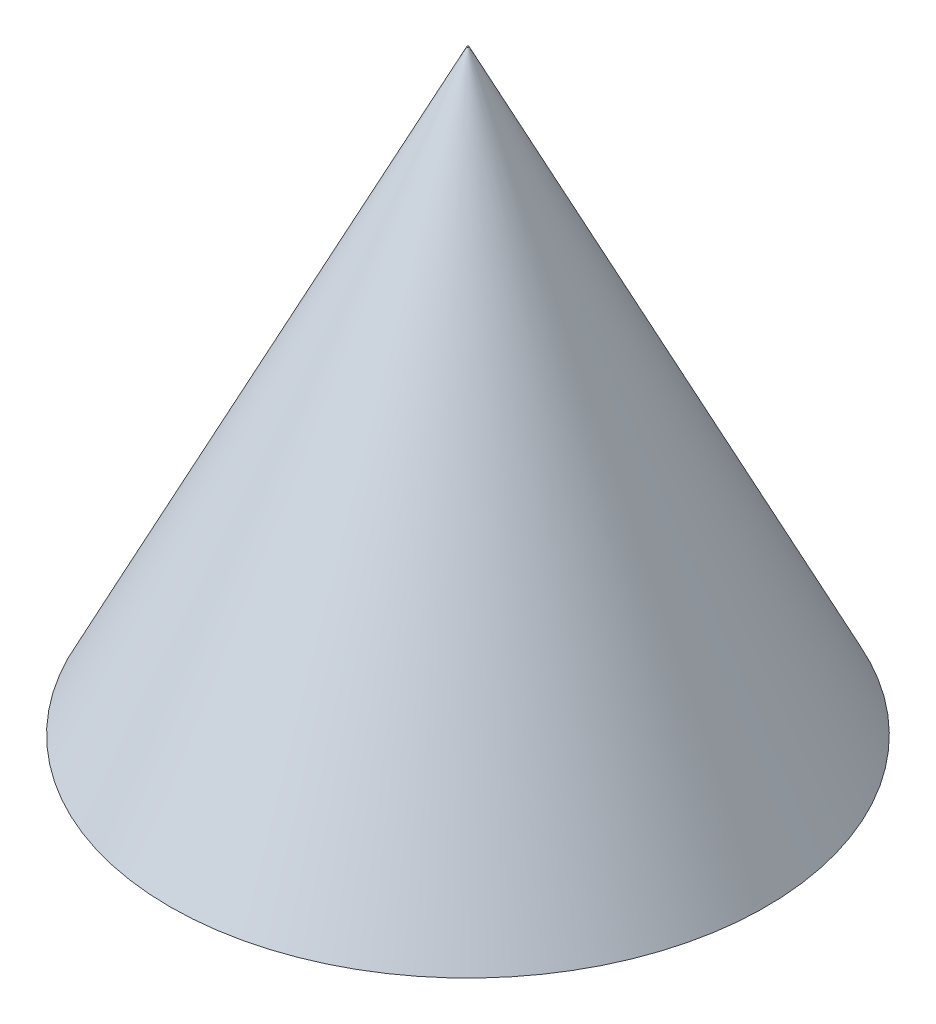
ISO-10303-21;
HEADER;
FILE_DESCRIPTION(('STEP AP214'),'2;1');
FILE_NAME('part.step','',(''),(''),'','','');
FILE_SCHEMA(('AUTOMOTIVE_DESIGN { 1 0 10303 214 1 1 1 1 }'));
ENDSEC;
DATA;
#1=APPLICATION_CONTEXT('core data for automotive mechanical design processes');
#2=APPLICATION_PROTOCOL_DEFINITION('international standard','automotive_design',2000,#1);
#3=PRODUCT_CONTEXT('',#1,'mechanical');
#4=PRODUCT('Part','Part','',(#3));
#5=PRODUCT_RELATED_PRODUCT_CATEGORY('part','',(#4));
#6=PRODUCT_DEFINITION_FORMATION('','',#4);
#7=PRODUCT_DEFINITION_CONTEXT('part definition',#1,'design');
#8=PRODUCT_DEFINITION('design','',#6,#7);
#9=PRODUCT_DEFINITION_SHAPE('','',#8);
#10=(LENGTH_UNIT() NAMED_UNIT(*) SI_UNIT(.MILLI.,.METRE.));
#11=(NAMED_UNIT(*) PLANE_ANGLE_UNIT() SI_UNIT($,.RADIAN.));
#12=(NAMED_UNIT(*) SI_UNIT($,.STERADIAN.) SOLID_ANGLE_UNIT());
#13=UNCERTAINTY_MEASURE_WITH_UNIT(LENGTH_MEASURE(1.E-05),#10,'distance_accuracy_value','');
#14=(GEOMETRIC_REPRESENTATION_CONTEXT(3) GLOBAL_UNCERTAINTY_ASSIGNED_CONTEXT((#13)) GLOBAL_UNIT_ASSIGNED_CONTEXT((#10,
#11,#12)) REPRESENTATION_CONTEXT('',''));
#15=CARTESIAN_POINT('',(0.,0.,0.));
#16=DIRECTION('',(0.,0.,1.));
#17=DIRECTION('',(1.,0.,0.));
#18=AXIS2_PLACEMENT_3D('',#15,#16,#17);
#19=CARTESIAN_POINT('',(0.,0.,0.));
#20=DIRECTION('',(0.,-1.,0.));
#21=DIRECTION('',(0.,0.,1.));
#22=AXIS2_PLACEMENT_3D('',#19,#20,#21);
#23=CONICAL_SURFACE('',#22,29.,0.462512251778498);
#24=CARTESIAN_POINT('',(0.,58.,0.));
#25=DIRECTION('',(0.,1.,0.));
#26=DIRECTION('',(0.,0.,1.));
#27=AXIS2_PLACEMENT_3D('',#24,#25,#26);
#28=CIRCLE('',#27,0.0822667329008956);
#29=CARTESIAN_POINT('',(0.,58.,0.0822667329008956));
#30=VERTEX_POINT('',#29);
#31=EDGE_CURVE('E10',#30,#30,#28,.T.);
#32=ORIENTED_EDGE('',*,*,#31,.F.);
#33=EDGE_LOOP('',(#32));
#34=FACE_BOUND('',#33,.T.);
#35=CARTESIAN_POINT('',(0.,0.,0.));
#36=DIRECTION('',(0.,1.,0.));
#37=DIRECTION('',(0.,0.,1.));
#38=AXIS2_PLACEMENT_3D('',#35,#36,#37);
#39=CIRCLE('',#38,29.);
#40=CARTESIAN_POINT('',(0.,0.,29.));
#41=VERTEX_POINT('',#40);
#42=EDGE_CURVE('E39',#41,#41,#39,.T.);
#43=ORIENTED_EDGE('',*,*,#42,.T.);
#44=EDGE_LOOP('',(#43));
#45=FACE_BOUND('',#44,.T.);
#46=ADVANCED_FACE('F33',(#34,#45),#23,.T.);
#47=CARTESIAN_POINT('',(0.,58.,0.));
#48=DIRECTION('',(0.,1.,0.));
#49=DIRECTION('',(0.,0.,1.));
#50=AXIS2_PLACEMENT_3D('',#47,#48,#49);
#51=PLANE('',#50);
#52=ORIENTED_EDGE('',*,*,#31,.T.);
#53=EDGE_LOOP('',(#52));
#54=FACE_BOUND('',#53,.T.);
#55=ADVANCED_FACE('F48',(#54),#51,.T.);
#56=CARTESIAN_POINT('',(0.,0.,0.));
#57=DIRECTION('',(0.,1.,0.));
#58=DIRECTION('',(0.,0.,1.));
#59=AXIS2_PLACEMENT_3D('',#56,#57,#58);
#60=PLANE('',#59);
#61=ORIENTED_EDGE('',*,*,#42,.F.);
#62=EDGE_LOOP('',(#61));
#63=FACE_BOUND('',#62,.T.);
#64=ADVANCED_FACE('F46',(#63),#60,.F.);
#65=CLOSED_SHELL('',(#46,#55,#64));
#66=MANIFOLD_SOLID_BREP('B2',#65);
#67=ADVANCED_BREP_SHAPE_REPRESENTATION('',(#18,#66),#14);
#68=SHAPE_DEFINITION_REPRESENTATION(#9,#67);
ENDSEC;
END-ISO-10303-21;
